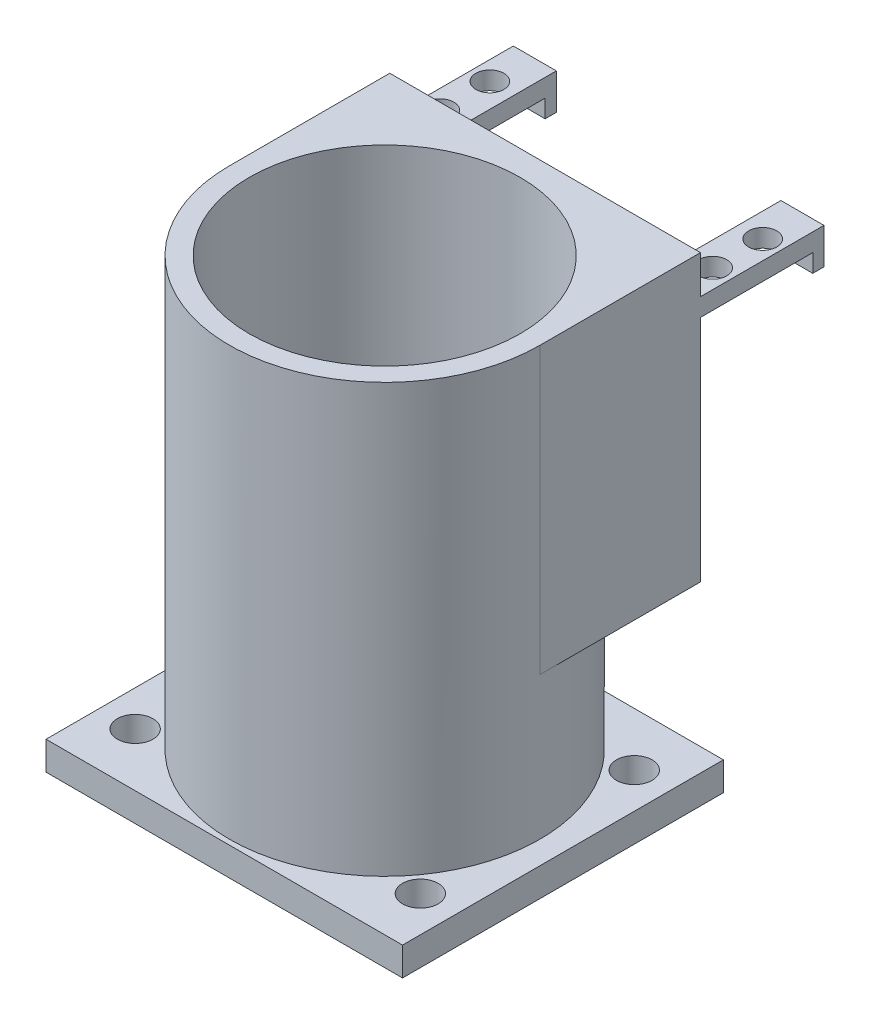
ISO-10303-21;
HEADER;
FILE_DESCRIPTION(('STEP AP214'),'2;1');
FILE_NAME('part.step','',(''),(''),'','','');
FILE_SCHEMA(('AUTOMOTIVE_DESIGN { 1 0 10303 214 1 1 1 1 }'));
ENDSEC;
DATA;
#1=APPLICATION_CONTEXT('core data for automotive mechanical design processes');
#2=APPLICATION_PROTOCOL_DEFINITION('international standard','automotive_design',2000,#1);
#3=PRODUCT_CONTEXT('',#1,'mechanical');
#4=PRODUCT('Part','Part','',(#3));
#5=PRODUCT_RELATED_PRODUCT_CATEGORY('part','',(#4));
#6=PRODUCT_DEFINITION_FORMATION('','',#4);
#7=PRODUCT_DEFINITION_CONTEXT('part definition',#1,'design');
#8=PRODUCT_DEFINITION('design','',#6,#7);
#9=PRODUCT_DEFINITION_SHAPE('','',#8);
#10=(LENGTH_UNIT() NAMED_UNIT(*) SI_UNIT(.MILLI.,.METRE.));
#11=(NAMED_UNIT(*) PLANE_ANGLE_UNIT() SI_UNIT($,.RADIAN.));
#12=(NAMED_UNIT(*) SI_UNIT($,.STERADIAN.) SOLID_ANGLE_UNIT());
#13=UNCERTAINTY_MEASURE_WITH_UNIT(LENGTH_MEASURE(1.E-05),#10,'distance_accuracy_value','');
#14=(GEOMETRIC_REPRESENTATION_CONTEXT(3) GLOBAL_UNCERTAINTY_ASSIGNED_CONTEXT((#13)) GLOBAL_UNIT_ASSIGNED_CONTEXT((#10,
#11,#12)) REPRESENTATION_CONTEXT('',''));
#15=CARTESIAN_POINT('',(0.,0.,0.));
#16=DIRECTION('',(0.,0.,1.));
#17=DIRECTION('',(1.,0.,0.));
#18=AXIS2_PLACEMENT_3D('',#15,#16,#17);
#19=CARTESIAN_POINT('',(51.75,71.28,-20.));
#20=DIRECTION('',(0.,1.,0.));
#21=DIRECTION('',(-1.,0.,0.));
#22=AXIS2_PLACEMENT_3D('',#19,#20,#21);
#23=PLANE('',#22);
#24=CARTESIAN_POINT('',(56.0499999999997,71.2800000000001,-5.55));
#25=DIRECTION('',(0.,-1.,0.));
#26=DIRECTION('',(-1.,0.,0.));
#27=AXIS2_PLACEMENT_3D('',#24,#25,#26);
#28=CIRCLE('',#27,2.5);
#29=CARTESIAN_POINT('',(53.5499999999997,71.2800000000001,-5.55));
#30=VERTEX_POINT('',#29);
#31=EDGE_CURVE('E241',#30,#30,#28,.T.);
#32=ORIENTED_EDGE('',*,*,#31,.F.);
#33=EDGE_LOOP('',(#32));
#34=FACE_BOUND('',#33,.T.);
#35=CARTESIAN_POINT('',(56.0499999999997,71.2800000000001,-14.45));
#36=DIRECTION('',(0.,-1.,0.));
#37=DIRECTION('',(1.,0.,0.));
#38=AXIS2_PLACEMENT_3D('',#35,#36,#37);
#39=CIRCLE('',#38,2.5);
#40=CARTESIAN_POINT('',(58.5499999999997,71.2800000000001,-14.45));
#41=VERTEX_POINT('',#40);
#42=EDGE_CURVE('E245',#41,#41,#39,.T.);
#43=ORIENTED_EDGE('',*,*,#42,.F.);
#44=EDGE_LOOP('',(#43));
#45=FACE_BOUND('',#44,.T.);
#46=DIRECTION('',(-1.,0.,0.));
#47=VECTOR('',#46,1.);
#48=CARTESIAN_POINT('',(59.4199999999997,71.2800000000001,-20.));
#49=LINE('',#48,#47);
#50=CARTESIAN_POINT('',(59.4199999999997,71.2800000000001,-20.));
#51=VERTEX_POINT('',#50);
#52=CARTESIAN_POINT('',(51.7499999999997,71.2800000000001,-20.));
#53=VERTEX_POINT('',#52);
#54=EDGE_CURVE('E198',#51,#53,#49,.T.);
#55=ORIENTED_EDGE('',*,*,#54,.F.);
#56=DIRECTION('',(0.,0.,1.));
#57=VECTOR('',#56,1.);
#58=CARTESIAN_POINT('',(59.42,71.28,-20.));
#59=LINE('',#58,#57);
#60=CARTESIAN_POINT('',(59.42,71.28,0.));
#61=VERTEX_POINT('',#60);
#62=EDGE_CURVE('E54',#51,#61,#59,.T.);
#63=ORIENTED_EDGE('',*,*,#62,.T.);
#64=DIRECTION('',(-1.,0.,0.));
#65=VECTOR('',#64,1.);
#66=CARTESIAN_POINT('',(51.75,71.28,0.));
#67=LINE('',#66,#65);
#68=CARTESIAN_POINT('',(51.75,71.28,0.));
#69=VERTEX_POINT('',#68);
#70=EDGE_CURVE('E269',#61,#69,#67,.T.);
#71=ORIENTED_EDGE('',*,*,#70,.T.);
#72=DIRECTION('',(0.,0.,1.));
#73=VECTOR('',#72,1.);
#74=CARTESIAN_POINT('',(51.75,71.28,-20.));
#75=LINE('',#74,#73);
#76=EDGE_CURVE('E271',#53,#69,#75,.T.);
#77=ORIENTED_EDGE('',*,*,#76,.F.);
#78=EDGE_LOOP('',(#55,#63,#71,#77));
#79=FACE_BOUND('',#78,.T.);
#80=ADVANCED_FACE('F39',(#34,#45,#79),#23,.F.);
#81=CARTESIAN_POINT('',(11.75,71.28,-20.));
#82=DIRECTION('',(0.,1.,0.));
#83=DIRECTION('',(-1.,0.,0.));
#84=AXIS2_PLACEMENT_3D('',#81,#82,#83);
#85=PLANE('',#84);
#86=CARTESIAN_POINT('',(7.45000000000001,71.28,-5.55));
#87=DIRECTION('',(0.,-1.,0.));
#88=DIRECTION('',(1.,0.,0.));
#89=AXIS2_PLACEMENT_3D('',#86,#87,#88);
#90=CIRCLE('',#89,2.5);
#91=CARTESIAN_POINT('',(9.95000000000001,71.28,-5.55));
#92=VERTEX_POINT('',#91);
#93=EDGE_CURVE('E244',#92,#92,#90,.T.);
#94=ORIENTED_EDGE('',*,*,#93,.F.);
#95=EDGE_LOOP('',(#94));
#96=FACE_BOUND('',#95,.T.);
#97=CARTESIAN_POINT('',(7.45000000000001,71.28,-14.45));
#98=DIRECTION('',(0.,-1.,0.));
#99=DIRECTION('',(-1.,0.,0.));
#100=AXIS2_PLACEMENT_3D('',#97,#98,#99);
#101=CIRCLE('',#100,2.5);
#102=CARTESIAN_POINT('',(4.95000000000001,71.28,-14.45));
#103=VERTEX_POINT('',#102);
#104=EDGE_CURVE('E240',#103,#103,#101,.T.);
#105=ORIENTED_EDGE('',*,*,#104,.F.);
#106=EDGE_LOOP('',(#105));
#107=FACE_BOUND('',#106,.T.);
#108=DIRECTION('',(-1.,0.,0.));
#109=VECTOR('',#108,1.);
#110=CARTESIAN_POINT('',(4.08000000000001,71.28,-20.));
#111=LINE('',#110,#109);
#112=CARTESIAN_POINT('',(11.75,71.28,-20.));
#113=VERTEX_POINT('',#112);
#114=CARTESIAN_POINT('',(4.08000000000001,71.28,-20.));
#115=VERTEX_POINT('',#114);
#116=EDGE_CURVE('E203',#113,#115,#111,.T.);
#117=ORIENTED_EDGE('',*,*,#116,.F.);
#118=DIRECTION('',(0.,0.,1.));
#119=VECTOR('',#118,1.);
#120=CARTESIAN_POINT('',(11.75,71.28,-20.));
#121=LINE('',#120,#119);
#122=CARTESIAN_POINT('',(11.75,71.28,0.));
#123=VERTEX_POINT('',#122);
#124=EDGE_CURVE('E291',#113,#123,#121,.T.);
#125=ORIENTED_EDGE('',*,*,#124,.T.);
#126=DIRECTION('',(-1.,0.,0.));
#127=VECTOR('',#126,1.);
#128=CARTESIAN_POINT('',(11.75,71.28,0.));
#129=LINE('',#128,#127);
#130=CARTESIAN_POINT('',(4.08000000000001,71.28,0.));
#131=VERTEX_POINT('',#130);
#132=EDGE_CURVE('E283',#123,#131,#129,.T.);
#133=ORIENTED_EDGE('',*,*,#132,.T.);
#134=DIRECTION('',(0.,0.,1.));
#135=VECTOR('',#134,1.);
#136=CARTESIAN_POINT('',(4.08000000000001,71.28,-20.));
#137=LINE('',#136,#135);
#138=EDGE_CURVE('E289',#115,#131,#137,.T.);
#139=ORIENTED_EDGE('',*,*,#138,.F.);
#140=EDGE_LOOP('',(#117,#125,#133,#139));
#141=FACE_BOUND('',#140,.T.);
#142=ADVANCED_FACE('F434',(#96,#107,#141),#85,.F.);
#143=CARTESIAN_POINT('',(0.,0.,0.));
#144=DIRECTION('',(0.,0.,-1.));
#145=DIRECTION('',(-1.,0.,0.));
#146=AXIS2_PLACEMENT_3D('',#143,#144,#145);
#147=PLANE('',#146);
#148=DIRECTION('',(0.,-1.,0.));
#149=VECTOR('',#148,1.);
#150=CARTESIAN_POINT('',(59.42,81.28,0.));
#151=LINE('',#150,#149);
#152=CARTESIAN_POINT('',(59.42,81.28,0.));
#153=VERTEX_POINT('',#152);
#154=CARTESIAN_POINT('',(59.42,74.48,0.));
#155=VERTEX_POINT('',#154);
#156=EDGE_CURVE('E307',#153,#155,#151,.T.);
#157=ORIENTED_EDGE('',*,*,#156,.T.);
#158=DIRECTION('',(1.,0.,0.));
#159=VECTOR('',#158,1.);
#160=CARTESIAN_POINT('',(51.75,74.48,0.));
#161=LINE('',#160,#159);
#162=CARTESIAN_POINT('',(51.75,74.48,0.));
#163=VERTEX_POINT('',#162);
#164=EDGE_CURVE('E267',#163,#155,#161,.T.);
#165=ORIENTED_EDGE('',*,*,#164,.F.);
#166=DIRECTION('',(0.,1.,0.));
#167=VECTOR('',#166,1.);
#168=CARTESIAN_POINT('',(51.75,74.48,0.));
#169=LINE('',#168,#167);
#170=EDGE_CURVE('E264',#69,#163,#169,.T.);
#171=ORIENTED_EDGE('',*,*,#170,.F.);
#172=ORIENTED_EDGE('',*,*,#70,.F.);
#173=CARTESIAN_POINT('',(59.42,30.48,0.));
#174=VERTEX_POINT('',#173);
#175=EDGE_CURVE('E310',#61,#174,#151,.T.);
#176=ORIENTED_EDGE('',*,*,#175,.T.);
#177=DIRECTION('',(-1.,0.,0.));
#178=VECTOR('',#177,1.);
#179=CARTESIAN_POINT('',(59.42,30.48,0.));
#180=LINE('',#179,#178);
#181=CARTESIAN_POINT('',(4.08,30.48,0.));
#182=VERTEX_POINT('',#181);
#183=EDGE_CURVE('E304',#174,#182,#180,.T.);
#184=ORIENTED_EDGE('',*,*,#183,.T.);
#185=DIRECTION('',(0.,1.,0.));
#186=VECTOR('',#185,1.);
#187=CARTESIAN_POINT('',(4.08000000000001,81.28,0.));
#188=LINE('',#187,#186);
#189=EDGE_CURVE('E300',#182,#131,#188,.T.);
#190=ORIENTED_EDGE('',*,*,#189,.T.);
#191=ORIENTED_EDGE('',*,*,#132,.F.);
#192=DIRECTION('',(0.,-1.,0.));
#193=VECTOR('',#192,1.);
#194=CARTESIAN_POINT('',(11.75,74.48,0.));
#195=LINE('',#194,#193);
#196=CARTESIAN_POINT('',(11.75,74.48,0.));
#197=VERTEX_POINT('',#196);
#198=EDGE_CURVE('E62',#197,#123,#195,.T.);
#199=ORIENTED_EDGE('',*,*,#198,.F.);
#200=DIRECTION('',(1.,0.,0.));
#201=VECTOR('',#200,1.);
#202=CARTESIAN_POINT('',(11.75,74.48,0.));
#203=LINE('',#202,#201);
#204=CARTESIAN_POINT('',(4.08000000000001,74.48,0.));
#205=VERTEX_POINT('',#204);
#206=EDGE_CURVE('E279',#205,#197,#203,.T.);
#207=ORIENTED_EDGE('',*,*,#206,.F.);
#208=CARTESIAN_POINT('',(4.08000000000001,81.28,0.));
#209=VERTEX_POINT('',#208);
#210=EDGE_CURVE('E303',#205,#209,#188,.T.);
#211=ORIENTED_EDGE('',*,*,#210,.T.);
#212=DIRECTION('',(1.,0.,0.));
#213=VECTOR('',#212,1.);
#214=CARTESIAN_POINT('',(59.42,81.28,0.));
#215=LINE('',#214,#213);
#216=EDGE_CURVE('E296',#209,#153,#215,.T.);
#217=ORIENTED_EDGE('',*,*,#216,.T.);
#218=EDGE_LOOP('',(#157,#165,#171,#172,#176,#184,#190,#191,#199,#207,#211,#217));
#219=FACE_BOUND('',#218,.T.);
#220=ADVANCED_FACE('F411',(#219),#147,.T.);
#221=CARTESIAN_POINT('',(0.,5.08,0.));
#222=DIRECTION('',(0.,1.,0.));
#223=DIRECTION('',(0.,0.,1.));
#224=AXIS2_PLACEMENT_3D('',#221,#222,#223);
#225=PLANE('',#224);
#226=CARTESIAN_POINT('',(31.75,5.08,28.575));
#227=DIRECTION('',(0.,1.,0.));
#228=DIRECTION('',(0.,0.,1.));
#229=AXIS2_PLACEMENT_3D('',#226,#227,#228);
#230=CIRCLE('',#229,27.67);
#231=CARTESIAN_POINT('',(31.75,5.08,56.245));
#232=VERTEX_POINT('',#231);
#233=EDGE_CURVE('E330',#232,#232,#230,.T.);
#234=ORIENTED_EDGE('',*,*,#233,.F.);
#235=EDGE_LOOP('',(#234));
#236=FACE_BOUND('',#235,.T.);
#237=CARTESIAN_POINT('',(57.15,5.08,47.625));
#238=DIRECTION('',(0.,1.,0.));
#239=DIRECTION('',(0.,0.,-1.));
#240=AXIS2_PLACEMENT_3D('',#237,#238,#239);
#241=CIRCLE('',#240,3.175);
#242=CARTESIAN_POINT('',(57.15,5.08,44.45));
#243=VERTEX_POINT('',#242);
#244=EDGE_CURVE('E343',#243,#243,#241,.T.);
#245=ORIENTED_EDGE('',*,*,#244,.F.);
#246=EDGE_LOOP('',(#245));
#247=FACE_BOUND('',#246,.T.);
#248=CARTESIAN_POINT('',(6.35,5.08,9.525));
#249=DIRECTION('',(0.,1.,0.));
#250=DIRECTION('',(0.,0.,1.));
#251=AXIS2_PLACEMENT_3D('',#248,#249,#250);
#252=CIRCLE('',#251,3.175);
#253=CARTESIAN_POINT('',(6.35,5.08,12.7));
#254=VERTEX_POINT('',#253);
#255=EDGE_CURVE('E355',#254,#254,#252,.T.);
#256=ORIENTED_EDGE('',*,*,#255,.F.);
#257=EDGE_LOOP('',(#256));
#258=FACE_BOUND('',#257,.T.);
#259=DIRECTION('',(0.,0.,1.));
#260=VECTOR('',#259,1.);
#261=CARTESIAN_POINT('',(0.,5.08,0.));
#262=LINE('',#261,#260);
#263=CARTESIAN_POINT('',(0.,5.08,0.));
#264=VERTEX_POINT('',#263);
#265=CARTESIAN_POINT('',(0.,5.08,57.15));
#266=VERTEX_POINT('',#265);
#267=EDGE_CURVE('E361',#264,#266,#262,.T.);
#268=ORIENTED_EDGE('',*,*,#267,.T.);
#269=DIRECTION('',(1.,0.,0.));
#270=VECTOR('',#269,1.);
#271=CARTESIAN_POINT('',(0.,5.08,57.15));
#272=LINE('',#271,#270);
#273=CARTESIAN_POINT('',(63.5,5.08,57.15));
#274=VERTEX_POINT('',#273);
#275=EDGE_CURVE('E364',#266,#274,#272,.T.);
#276=ORIENTED_EDGE('',*,*,#275,.T.);
#277=DIRECTION('',(0.,0.,-1.));
#278=VECTOR('',#277,1.);
#279=CARTESIAN_POINT('',(63.5,5.08,0.));
#280=LINE('',#279,#278);
#281=CARTESIAN_POINT('',(63.5,5.08,0.));
#282=VERTEX_POINT('',#281);
#283=EDGE_CURVE('E367',#274,#282,#280,.T.);
#284=ORIENTED_EDGE('',*,*,#283,.T.);
#285=DIRECTION('',(-1.,0.,0.));
#286=VECTOR('',#285,1.);
#287=CARTESIAN_POINT('',(0.,5.08,0.));
#288=LINE('',#287,#286);
#289=EDGE_CURVE('E369',#282,#264,#288,.T.);
#290=ORIENTED_EDGE('',*,*,#289,.T.);
#291=EDGE_LOOP('',(#268,#276,#284,#290));
#292=FACE_BOUND('',#291,.T.);
#293=CARTESIAN_POINT('',(57.15,5.08,9.525));
#294=DIRECTION('',(0.,1.,0.));
#295=DIRECTION('',(0.,0.,1.));
#296=AXIS2_PLACEMENT_3D('',#293,#294,#295);
#297=CIRCLE('',#296,3.175);
#298=CARTESIAN_POINT('',(57.15,5.08,12.7));
#299=VERTEX_POINT('',#298);
#300=EDGE_CURVE('E349',#299,#299,#297,.T.);
#301=ORIENTED_EDGE('',*,*,#300,.F.);
#302=EDGE_LOOP('',(#301));
#303=FACE_BOUND('',#302,.T.);
#304=CARTESIAN_POINT('',(6.35,5.08,47.625));
#305=DIRECTION('',(0.,1.,0.));
#306=DIRECTION('',(0.,0.,-1.));
#307=AXIS2_PLACEMENT_3D('',#304,#305,#306);
#308=CIRCLE('',#307,3.175);
#309=CARTESIAN_POINT('',(6.35,5.08,44.45));
#310=VERTEX_POINT('',#309);
#311=EDGE_CURVE('E337',#310,#310,#308,.T.);
#312=ORIENTED_EDGE('',*,*,#311,.F.);
#313=EDGE_LOOP('',(#312));
#314=FACE_BOUND('',#313,.T.);
#315=ADVANCED_FACE('F408',(#236,#247,#258,#292,#303,#314),#225,.T.);
#316=CARTESIAN_POINT('',(0.,0.,0.));
#317=DIRECTION('',(0.,1.,0.));
#318=DIRECTION('',(0.,0.,1.));
#319=AXIS2_PLACEMENT_3D('',#316,#317,#318);
#320=PLANE('',#319);
#321=DIRECTION('',(0.,0.,1.));
#322=VECTOR('',#321,1.);
#323=CARTESIAN_POINT('',(0.,0.,0.));
#324=LINE('',#323,#322);
#325=CARTESIAN_POINT('',(0.,0.,0.));
#326=VERTEX_POINT('',#325);
#327=CARTESIAN_POINT('',(0.,0.,57.15));
#328=VERTEX_POINT('',#327);
#329=EDGE_CURVE('E358',#326,#328,#324,.T.);
#330=ORIENTED_EDGE('',*,*,#329,.F.);
#331=DIRECTION('',(-1.,0.,0.));
#332=VECTOR('',#331,1.);
#333=CARTESIAN_POINT('',(0.,0.,0.));
#334=LINE('',#333,#332);
#335=CARTESIAN_POINT('',(63.5,0.,0.));
#336=VERTEX_POINT('',#335);
#337=EDGE_CURVE('E365',#336,#326,#334,.T.);
#338=ORIENTED_EDGE('',*,*,#337,.F.);
#339=DIRECTION('',(0.,0.,-1.));
#340=VECTOR('',#339,1.);
#341=CARTESIAN_POINT('',(63.5,0.,0.));
#342=LINE('',#341,#340);
#343=CARTESIAN_POINT('',(63.5,0.,57.15));
#344=VERTEX_POINT('',#343);
#345=EDGE_CURVE('E376',#344,#336,#342,.T.);
#346=ORIENTED_EDGE('',*,*,#345,.F.);
#347=DIRECTION('',(1.,0.,0.));
#348=VECTOR('',#347,1.);
#349=CARTESIAN_POINT('',(0.,0.,57.15));
#350=LINE('',#349,#348);
#351=EDGE_CURVE('E374',#328,#344,#350,.T.);
#352=ORIENTED_EDGE('',*,*,#351,.F.);
#353=EDGE_LOOP('',(#330,#338,#346,#352));
#354=FACE_BOUND('',#353,.T.);
#355=CARTESIAN_POINT('',(6.35,0.,9.525));
#356=DIRECTION('',(0.,1.,0.));
#357=DIRECTION('',(0.,0.,1.));
#358=AXIS2_PLACEMENT_3D('',#355,#356,#357);
#359=CIRCLE('',#358,3.175);
#360=CARTESIAN_POINT('',(6.35,0.,12.7));
#361=VERTEX_POINT('',#360);
#362=EDGE_CURVE('E352',#361,#361,#359,.T.);
#363=ORIENTED_EDGE('',*,*,#362,.T.);
#364=EDGE_LOOP('',(#363));
#365=FACE_BOUND('',#364,.T.);
#366=CARTESIAN_POINT('',(57.15,0.,9.525));
#367=DIRECTION('',(0.,1.,0.));
#368=DIRECTION('',(0.,0.,1.));
#369=AXIS2_PLACEMENT_3D('',#366,#367,#368);
#370=CIRCLE('',#369,3.175);
#371=CARTESIAN_POINT('',(57.15,0.,12.7));
#372=VERTEX_POINT('',#371);
#373=EDGE_CURVE('E346',#372,#372,#370,.T.);
#374=ORIENTED_EDGE('',*,*,#373,.T.);
#375=EDGE_LOOP('',(#374));
#376=FACE_BOUND('',#375,.T.);
#377=CARTESIAN_POINT('',(57.15,0.,47.625));
#378=DIRECTION('',(0.,1.,0.));
#379=DIRECTION('',(0.,0.,-1.));
#380=AXIS2_PLACEMENT_3D('',#377,#378,#379);
#381=CIRCLE('',#380,3.175);
#382=CARTESIAN_POINT('',(57.15,0.,44.45));
#383=VERTEX_POINT('',#382);
#384=EDGE_CURVE('E340',#383,#383,#381,.T.);
#385=ORIENTED_EDGE('',*,*,#384,.T.);
#386=EDGE_LOOP('',(#385));
#387=FACE_BOUND('',#386,.T.);
#388=CARTESIAN_POINT('',(6.35,0.,47.625));
#389=DIRECTION('',(0.,1.,0.));
#390=DIRECTION('',(0.,0.,-1.));
#391=AXIS2_PLACEMENT_3D('',#388,#389,#390);
#392=CIRCLE('',#391,3.175);
#393=CARTESIAN_POINT('',(6.35,0.,44.45));
#394=VERTEX_POINT('',#393);
#395=EDGE_CURVE('E334',#394,#394,#392,.T.);
#396=ORIENTED_EDGE('',*,*,#395,.T.);
#397=EDGE_LOOP('',(#396));
#398=FACE_BOUND('',#397,.T.);
#399=ADVANCED_FACE('F397',(#354,#365,#376,#387,#398),#320,.F.);
#400=CARTESIAN_POINT('',(0.,5.08,0.));
#401=DIRECTION('',(1.,0.,0.));
#402=DIRECTION('',(0.,0.,-1.));
#403=AXIS2_PLACEMENT_3D('',#400,#401,#402);
#404=PLANE('',#403);
#405=ORIENTED_EDGE('',*,*,#329,.T.);
#406=DIRECTION('',(0.,-1.,0.));
#407=VECTOR('',#406,1.);
#408=CARTESIAN_POINT('',(0.,5.08,57.15));
#409=LINE('',#408,#407);
#410=EDGE_CURVE('E47',#266,#328,#409,.T.);
#411=ORIENTED_EDGE('',*,*,#410,.F.);
#412=ORIENTED_EDGE('',*,*,#267,.F.);
#413=DIRECTION('',(0.,-1.,0.));
#414=VECTOR('',#413,1.);
#415=CARTESIAN_POINT('',(0.,5.08,0.));
#416=LINE('',#415,#414);
#417=EDGE_CURVE('E371',#264,#326,#416,.T.);
#418=ORIENTED_EDGE('',*,*,#417,.T.);
#419=EDGE_LOOP('',(#405,#411,#412,#418));
#420=FACE_BOUND('',#419,.T.);
#421=ADVANCED_FACE('F41',(#420),#404,.F.);
#422=CARTESIAN_POINT('',(0.,5.08,57.15));
#423=DIRECTION('',(0.,0.,-1.));
#424=DIRECTION('',(-1.,0.,0.));
#425=AXIS2_PLACEMENT_3D('',#422,#423,#424);
#426=PLANE('',#425);
#427=ORIENTED_EDGE('',*,*,#351,.T.);
#428=DIRECTION('',(0.,-1.,0.));
#429=VECTOR('',#428,1.);
#430=CARTESIAN_POINT('',(63.5,5.08,57.15));
#431=LINE('',#430,#429);
#432=EDGE_CURVE('E384',#274,#344,#431,.T.);
#433=ORIENTED_EDGE('',*,*,#432,.F.);
#434=ORIENTED_EDGE('',*,*,#275,.F.);
#435=ORIENTED_EDGE('',*,*,#410,.T.);
#436=EDGE_LOOP('',(#427,#433,#434,#435));
#437=FACE_BOUND('',#436,.T.);
#438=ADVANCED_FACE('F389',(#437),#426,.F.);
#439=CARTESIAN_POINT('',(63.5,5.08,0.));
#440=DIRECTION('',(-1.,0.,0.));
#441=DIRECTION('',(0.,0.,1.));
#442=AXIS2_PLACEMENT_3D('',#439,#440,#441);
#443=PLANE('',#442);
#444=ORIENTED_EDGE('',*,*,#345,.T.);
#445=DIRECTION('',(0.,-1.,0.));
#446=VECTOR('',#445,1.);
#447=CARTESIAN_POINT('',(63.5,5.08,0.));
#448=LINE('',#447,#446);
#449=EDGE_CURVE('E381',#282,#336,#448,.T.);
#450=ORIENTED_EDGE('',*,*,#449,.F.);
#451=ORIENTED_EDGE('',*,*,#283,.F.);
#452=ORIENTED_EDGE('',*,*,#432,.T.);
#453=EDGE_LOOP('',(#444,#450,#451,#452));
#454=FACE_BOUND('',#453,.T.);
#455=ADVANCED_FACE('F402',(#454),#443,.F.);
#456=CARTESIAN_POINT('',(0.,5.08,0.));
#457=DIRECTION('',(0.,0.,1.));
#458=DIRECTION('',(1.,0.,0.));
#459=AXIS2_PLACEMENT_3D('',#456,#457,#458);
#460=PLANE('',#459);
#461=ORIENTED_EDGE('',*,*,#337,.T.);
#462=ORIENTED_EDGE('',*,*,#417,.F.);
#463=ORIENTED_EDGE('',*,*,#289,.F.);
#464=ORIENTED_EDGE('',*,*,#449,.T.);
#465=EDGE_LOOP('',(#461,#462,#463,#464));
#466=FACE_BOUND('',#465,.T.);
#467=ADVANCED_FACE('F406',(#466),#460,.F.);
#468=CARTESIAN_POINT('',(6.35,5.08,9.525));
#469=DIRECTION('',(0.,-1.,0.));
#470=DIRECTION('',(0.,0.,-1.));
#471=AXIS2_PLACEMENT_3D('',#468,#469,#470);
#472=CYLINDRICAL_SURFACE('',#471,3.175);
#473=ORIENTED_EDGE('',*,*,#255,.T.);
#474=EDGE_LOOP('',(#473));
#475=FACE_BOUND('',#474,.T.);
#476=ORIENTED_EDGE('',*,*,#362,.F.);
#477=EDGE_LOOP('',(#476));
#478=FACE_BOUND('',#477,.T.);
#479=ADVANCED_FACE('F494',(#475,#478),#472,.F.);
#480=CARTESIAN_POINT('',(57.15,5.08,9.525));
#481=DIRECTION('',(0.,-1.,0.));
#482=DIRECTION('',(0.,0.,-1.));
#483=AXIS2_PLACEMENT_3D('',#480,#481,#482);
#484=CYLINDRICAL_SURFACE('',#483,3.175);
#485=ORIENTED_EDGE('',*,*,#300,.T.);
#486=EDGE_LOOP('',(#485));
#487=FACE_BOUND('',#486,.T.);
#488=ORIENTED_EDGE('',*,*,#373,.F.);
#489=EDGE_LOOP('',(#488));
#490=FACE_BOUND('',#489,.T.);
#491=ADVANCED_FACE('F490',(#487,#490),#484,.F.);
#492=CARTESIAN_POINT('',(57.15,5.08,47.625));
#493=DIRECTION('',(0.,-1.,0.));
#494=DIRECTION('',(0.,0.,-1.));
#495=AXIS2_PLACEMENT_3D('',#492,#493,#494);
#496=CYLINDRICAL_SURFACE('',#495,3.175);
#497=ORIENTED_EDGE('',*,*,#244,.T.);
#498=EDGE_LOOP('',(#497));
#499=FACE_BOUND('',#498,.T.);
#500=ORIENTED_EDGE('',*,*,#384,.F.);
#501=EDGE_LOOP('',(#500));
#502=FACE_BOUND('',#501,.T.);
#503=ADVANCED_FACE('F423',(#499,#502),#496,.F.);
#504=CARTESIAN_POINT('',(6.35,5.08,47.625));
#505=DIRECTION('',(0.,-1.,0.));
#506=DIRECTION('',(0.,0.,-1.));
#507=AXIS2_PLACEMENT_3D('',#504,#505,#506);
#508=CYLINDRICAL_SURFACE('',#507,3.175);
#509=ORIENTED_EDGE('',*,*,#311,.T.);
#510=EDGE_LOOP('',(#509));
#511=FACE_BOUND('',#510,.T.);
#512=ORIENTED_EDGE('',*,*,#395,.F.);
#513=EDGE_LOOP('',(#512));
#514=FACE_BOUND('',#513,.T.);
#515=ADVANCED_FACE('F419',(#511,#514),#508,.F.);
#516=CARTESIAN_POINT('',(31.75,81.28,28.575));
#517=DIRECTION('',(0.,1.,0.));
#518=DIRECTION('',(0.,0.,1.));
#519=AXIS2_PLACEMENT_3D('',#516,#517,#518);
#520=PLANE('',#519);
#521=CARTESIAN_POINT('',(31.75,81.28,28.575));
#522=DIRECTION('',(0.,1.,0.));
#523=DIRECTION('',(0.,0.,1.));
#524=AXIS2_PLACEMENT_3D('',#521,#522,#523);
#525=CIRCLE('',#524,27.67);
#526=CARTESIAN_POINT('',(4.08000000000001,81.28,28.575));
#527=VERTEX_POINT('',#526);
#528=CARTESIAN_POINT('',(59.42,81.28,28.575));
#529=VERTEX_POINT('',#528);
#530=EDGE_CURVE('E331',#527,#529,#525,.T.);
#531=ORIENTED_EDGE('',*,*,#530,.T.);
#532=DIRECTION('',(0.,0.,-1.));
#533=VECTOR('',#532,1.);
#534=CARTESIAN_POINT('',(59.42,81.28,57.151));
#535=LINE('',#534,#533);
#536=EDGE_CURVE('E295',#529,#153,#535,.T.);
#537=ORIENTED_EDGE('',*,*,#536,.T.);
#538=ORIENTED_EDGE('',*,*,#216,.F.);
#539=DIRECTION('',(0.,0.,-1.));
#540=VECTOR('',#539,1.);
#541=CARTESIAN_POINT('',(4.08000000000001,81.28,57.151));
#542=LINE('',#541,#540);
#543=EDGE_CURVE('E313',#527,#209,#542,.T.);
#544=ORIENTED_EDGE('',*,*,#543,.F.);
#545=EDGE_LOOP('',(#531,#537,#538,#544));
#546=FACE_BOUND('',#545,.T.);
#547=CARTESIAN_POINT('',(31.75,81.28,28.575));
#548=DIRECTION('',(0.,1.,0.));
#549=DIRECTION('',(0.,0.,1.));
#550=AXIS2_PLACEMENT_3D('',#547,#548,#549);
#551=CIRCLE('',#550,24.13);
#552=CARTESIAN_POINT('',(31.75,81.28,52.705));
#553=VERTEX_POINT('',#552);
#554=EDGE_CURVE('E323',#553,#553,#551,.T.);
#555=ORIENTED_EDGE('',*,*,#554,.F.);
#556=EDGE_LOOP('',(#555));
#557=FACE_BOUND('',#556,.T.);
#558=ADVANCED_FACE('F422',(#546,#557),#520,.T.);
#559=CARTESIAN_POINT('',(31.75,81.28,28.575));
#560=DIRECTION('',(0.,-1.,0.));
#561=DIRECTION('',(0.,0.,-1.));
#562=AXIS2_PLACEMENT_3D('',#559,#560,#561);
#563=CYLINDRICAL_SURFACE('',#562,27.67);
#564=ORIENTED_EDGE('',*,*,#530,.F.);
#565=DIRECTION('',(0.,-1.,0.));
#566=VECTOR('',#565,1.);
#567=CARTESIAN_POINT('',(4.08000000000001,81.28,28.575));
#568=LINE('',#567,#566);
#569=CARTESIAN_POINT('',(4.08000000000001,30.48,28.575));
#570=VERTEX_POINT('',#569);
#571=EDGE_CURVE('E312',#570,#527,#568,.F.);
#572=ORIENTED_EDGE('',*,*,#571,.F.);
#573=CARTESIAN_POINT('',(31.75,30.48,28.575));
#574=DIRECTION('',(0.,-1.,0.));
#575=DIRECTION('',(1.,0.,0.));
#576=AXIS2_PLACEMENT_3D('',#573,#574,#575);
#577=CIRCLE('',#576,27.67);
#578=CARTESIAN_POINT('',(59.42,30.48,28.575));
#579=VERTEX_POINT('',#578);
#580=EDGE_CURVE('E316',#579,#570,#577,.F.);
#581=ORIENTED_EDGE('',*,*,#580,.F.);
#582=DIRECTION('',(0.,-1.,0.));
#583=VECTOR('',#582,1.);
#584=CARTESIAN_POINT('',(59.42,81.28,28.575));
#585=LINE('',#584,#583);
#586=EDGE_CURVE('E299',#579,#529,#585,.F.);
#587=ORIENTED_EDGE('',*,*,#586,.T.);
#588=EDGE_LOOP('',(#564,#572,#581,#587));
#589=FACE_BOUND('',#588,.T.);
#590=ORIENTED_EDGE('',*,*,#233,.T.);
#591=EDGE_LOOP('',(#590));
#592=FACE_BOUND('',#591,.T.);
#593=ADVANCED_FACE('F480',(#589,#592),#563,.T.);
#594=CARTESIAN_POINT('',(31.75,81.28,28.575));
#595=DIRECTION('',(0.,-1.,0.));
#596=DIRECTION('',(0.,0.,-1.));
#597=AXIS2_PLACEMENT_3D('',#594,#595,#596);
#598=CYLINDRICAL_SURFACE('',#597,24.13);
#599=ORIENTED_EDGE('',*,*,#554,.T.);
#600=EDGE_LOOP('',(#599));
#601=FACE_BOUND('',#600,.T.);
#602=CARTESIAN_POINT('',(31.75,5.08,28.575));
#603=DIRECTION('',(0.,1.,0.));
#604=DIRECTION('',(0.,0.,1.));
#605=AXIS2_PLACEMENT_3D('',#602,#603,#604);
#606=CIRCLE('',#605,24.13);
#607=CARTESIAN_POINT('',(31.75,5.08,52.705));
#608=VERTEX_POINT('',#607);
#609=EDGE_CURVE('E12',#608,#608,#606,.F.);
#610=ORIENTED_EDGE('',*,*,#609,.T.);
#611=EDGE_LOOP('',(#610));
#612=FACE_BOUND('',#611,.T.);
#613=ADVANCED_FACE('F477',(#601,#612),#598,.F.);
#614=ORIENTED_EDGE('',*,*,#609,.F.);
#615=EDGE_LOOP('',(#614));
#616=FACE_BOUND('',#615,.T.);
#617=ADVANCED_FACE('F414',(#616),#225,.T.);
#618=CARTESIAN_POINT('',(4.08000000000001,81.28,57.151));
#619=DIRECTION('',(-1.,0.,0.));
#620=DIRECTION('',(0.,-1.,0.));
#621=AXIS2_PLACEMENT_3D('',#618,#619,#620);
#622=PLANE('',#621);
#623=DIRECTION('',(0.,0.,-1.));
#624=VECTOR('',#623,1.);
#625=CARTESIAN_POINT('',(4.08,30.48,57.151));
#626=LINE('',#625,#624);
#627=EDGE_CURVE('E317',#570,#182,#626,.T.);
#628=ORIENTED_EDGE('',*,*,#627,.F.);
#629=ORIENTED_EDGE('',*,*,#571,.T.);
#630=ORIENTED_EDGE('',*,*,#543,.T.);
#631=ORIENTED_EDGE('',*,*,#210,.F.);
#632=DIRECTION('',(0.,0.,1.));
#633=VECTOR('',#632,1.);
#634=CARTESIAN_POINT('',(4.08000000000001,74.48,-20.));
#635=LINE('',#634,#633);
#636=CARTESIAN_POINT('',(4.08000000000001,74.48,-22.));
#637=VERTEX_POINT('',#636);
#638=EDGE_CURVE('E286',#637,#205,#635,.T.);
#639=ORIENTED_EDGE('',*,*,#638,.F.);
#640=DIRECTION('',(0.,1.,0.));
#641=VECTOR('',#640,1.);
#642=CARTESIAN_POINT('',(4.08000000000001,74.48,-22.));
#643=LINE('',#642,#641);
#644=CARTESIAN_POINT('',(4.08000000000001,68.08,-22.));
#645=VERTEX_POINT('',#644);
#646=EDGE_CURVE('E226',#645,#637,#643,.T.);
#647=ORIENTED_EDGE('',*,*,#646,.F.);
#648=DIRECTION('',(0.,0.,-1.));
#649=VECTOR('',#648,1.);
#650=CARTESIAN_POINT('',(4.08000000000001,68.08,-20.));
#651=LINE('',#650,#649);
#652=CARTESIAN_POINT('',(4.08000000000001,68.08,-20.));
#653=VERTEX_POINT('',#652);
#654=EDGE_CURVE('E205',#653,#645,#651,.T.);
#655=ORIENTED_EDGE('',*,*,#654,.F.);
#656=DIRECTION('',(0.,1.,0.));
#657=VECTOR('',#656,1.);
#658=CARTESIAN_POINT('',(4.08000000000001,68.08,-20.));
#659=LINE('',#658,#657);
#660=EDGE_CURVE('E218',#653,#115,#659,.T.);
#661=ORIENTED_EDGE('',*,*,#660,.T.);
#662=ORIENTED_EDGE('',*,*,#138,.T.);
#663=ORIENTED_EDGE('',*,*,#189,.F.);
#664=EDGE_LOOP('',(#628,#629,#630,#631,#639,#647,#655,#661,#662,#663));
#665=FACE_BOUND('',#664,.T.);
#666=ADVANCED_FACE('F467',(#665),#622,.T.);
#667=CARTESIAN_POINT('',(59.42,30.48,57.151));
#668=DIRECTION('',(0.,-1.,0.));
#669=DIRECTION('',(1.,0.,0.));
#670=AXIS2_PLACEMENT_3D('',#667,#668,#669);
#671=PLANE('',#670);
#672=DIRECTION('',(0.,0.,-1.));
#673=VECTOR('',#672,1.);
#674=CARTESIAN_POINT('',(59.42,30.48,57.151));
#675=LINE('',#674,#673);
#676=EDGE_CURVE('E319',#579,#174,#675,.T.);
#677=ORIENTED_EDGE('',*,*,#676,.F.);
#678=ORIENTED_EDGE('',*,*,#580,.T.);
#679=ORIENTED_EDGE('',*,*,#627,.T.);
#680=ORIENTED_EDGE('',*,*,#183,.F.);
#681=EDGE_LOOP('',(#677,#678,#679,#680));
#682=FACE_BOUND('',#681,.T.);
#683=ADVANCED_FACE('F470',(#682),#671,.T.);
#684=CARTESIAN_POINT('',(59.42,81.28,57.151));
#685=DIRECTION('',(1.,0.,0.));
#686=DIRECTION('',(0.,1.,0.));
#687=AXIS2_PLACEMENT_3D('',#684,#685,#686);
#688=PLANE('',#687);
#689=ORIENTED_EDGE('',*,*,#586,.F.);
#690=ORIENTED_EDGE('',*,*,#676,.T.);
#691=ORIENTED_EDGE('',*,*,#175,.F.);
#692=ORIENTED_EDGE('',*,*,#62,.F.);
#693=DIRECTION('',(0.,1.,0.));
#694=VECTOR('',#693,1.);
#695=CARTESIAN_POINT('',(59.4199999999997,68.0800000000001,-20.));
#696=LINE('',#695,#694);
#697=CARTESIAN_POINT('',(59.4199999999997,68.0800000000001,-20.));
#698=VERTEX_POINT('',#697);
#699=EDGE_CURVE('E182',#698,#51,#696,.T.);
#700=ORIENTED_EDGE('',*,*,#699,.F.);
#701=DIRECTION('',(0.,0.,1.));
#702=VECTOR('',#701,1.);
#703=CARTESIAN_POINT('',(59.4199999999997,68.0800000000001,-20.));
#704=LINE('',#703,#702);
#705=CARTESIAN_POINT('',(59.4199999999997,68.0800000000001,-22.));
#706=VERTEX_POINT('',#705);
#707=EDGE_CURVE('E189',#706,#698,#704,.T.);
#708=ORIENTED_EDGE('',*,*,#707,.F.);
#709=DIRECTION('',(0.,-1.,0.));
#710=VECTOR('',#709,1.);
#711=CARTESIAN_POINT('',(59.42,74.48,-22.));
#712=LINE('',#711,#710);
#713=CARTESIAN_POINT('',(59.42,74.48,-22.));
#714=VERTEX_POINT('',#713);
#715=EDGE_CURVE('E232',#714,#706,#712,.T.);
#716=ORIENTED_EDGE('',*,*,#715,.F.);
#717=DIRECTION('',(0.,0.,1.));
#718=VECTOR('',#717,1.);
#719=CARTESIAN_POINT('',(59.42,74.48,-20.));
#720=LINE('',#719,#718);
#721=EDGE_CURVE('E274',#714,#155,#720,.T.);
#722=ORIENTED_EDGE('',*,*,#721,.T.);
#723=ORIENTED_EDGE('',*,*,#156,.F.);
#724=ORIENTED_EDGE('',*,*,#536,.F.);
#725=EDGE_LOOP('',(#689,#690,#691,#692,#700,#708,#716,#722,#723,#724));
#726=FACE_BOUND('',#725,.T.);
#727=ADVANCED_FACE('F201',(#726),#688,.T.);
#728=CARTESIAN_POINT('',(11.75,74.48,-20.));
#729=DIRECTION('',(0.,-1.,0.));
#730=DIRECTION('',(0.,0.,-1.));
#731=AXIS2_PLACEMENT_3D('',#728,#729,#730);
#732=PLANE('',#731);
#733=CARTESIAN_POINT('',(7.45,74.48,-14.45));
#734=DIRECTION('',(0.,-1.,0.));
#735=DIRECTION('',(0.,0.,-1.));
#736=AXIS2_PLACEMENT_3D('',#733,#734,#735);
#737=CIRCLE('',#736,2.5);
#738=CARTESIAN_POINT('',(7.45,74.48,-16.95));
#739=VERTEX_POINT('',#738);
#740=EDGE_CURVE('E261',#739,#739,#737,.T.);
#741=ORIENTED_EDGE('',*,*,#740,.T.);
#742=EDGE_LOOP('',(#741));
#743=FACE_BOUND('',#742,.T.);
#744=CARTESIAN_POINT('',(7.45,74.48,-5.55));
#745=DIRECTION('',(0.,-1.,0.));
#746=DIRECTION('',(0.,0.,-1.));
#747=AXIS2_PLACEMENT_3D('',#744,#745,#746);
#748=CIRCLE('',#747,2.5);
#749=CARTESIAN_POINT('',(7.45,74.48,-8.05));
#750=VERTEX_POINT('',#749);
#751=EDGE_CURVE('E258',#750,#750,#748,.T.);
#752=ORIENTED_EDGE('',*,*,#751,.T.);
#753=EDGE_LOOP('',(#752));
#754=FACE_BOUND('',#753,.T.);
#755=ORIENTED_EDGE('',*,*,#206,.T.);
#756=DIRECTION('',(0.,0.,1.));
#757=VECTOR('',#756,1.);
#758=CARTESIAN_POINT('',(11.75,74.48,-20.));
#759=LINE('',#758,#757);
#760=CARTESIAN_POINT('',(11.75,74.48,-22.));
#761=VERTEX_POINT('',#760);
#762=EDGE_CURVE('E293',#761,#197,#759,.T.);
#763=ORIENTED_EDGE('',*,*,#762,.F.);
#764=DIRECTION('',(1.,0.,0.));
#765=VECTOR('',#764,1.);
#766=CARTESIAN_POINT('',(11.75,74.48,-22.));
#767=LINE('',#766,#765);
#768=EDGE_CURVE('E229',#637,#761,#767,.T.);
#769=ORIENTED_EDGE('',*,*,#768,.F.);
#770=ORIENTED_EDGE('',*,*,#638,.T.);
#771=EDGE_LOOP('',(#755,#763,#769,#770));
#772=FACE_BOUND('',#771,.T.);
#773=ADVANCED_FACE('F460',(#743,#754,#772),#732,.F.);
#774=CARTESIAN_POINT('',(11.75,74.48,-20.));
#775=DIRECTION('',(-1.,0.,0.));
#776=DIRECTION('',(0.,0.,1.));
#777=AXIS2_PLACEMENT_3D('',#774,#775,#776);
#778=PLANE('',#777);
#779=ORIENTED_EDGE('',*,*,#198,.T.);
#780=ORIENTED_EDGE('',*,*,#124,.F.);
#781=DIRECTION('',(0.,1.,0.));
#782=VECTOR('',#781,1.);
#783=CARTESIAN_POINT('',(11.75,68.08,-20.));
#784=LINE('',#783,#782);
#785=CARTESIAN_POINT('',(11.75,68.08,-20.));
#786=VERTEX_POINT('',#785);
#787=EDGE_CURVE('E222',#786,#113,#784,.T.);
#788=ORIENTED_EDGE('',*,*,#787,.F.);
#789=DIRECTION('',(0.,0.,1.));
#790=VECTOR('',#789,1.);
#791=CARTESIAN_POINT('',(11.75,68.08,-20.));
#792=LINE('',#791,#790);
#793=CARTESIAN_POINT('',(11.75,68.08,-22.));
#794=VERTEX_POINT('',#793);
#795=EDGE_CURVE('E215',#794,#786,#792,.T.);
#796=ORIENTED_EDGE('',*,*,#795,.F.);
#797=DIRECTION('',(0.,-1.,0.));
#798=VECTOR('',#797,1.);
#799=CARTESIAN_POINT('',(11.75,74.48,-22.));
#800=LINE('',#799,#798);
#801=EDGE_CURVE('E224',#761,#794,#800,.T.);
#802=ORIENTED_EDGE('',*,*,#801,.F.);
#803=ORIENTED_EDGE('',*,*,#762,.T.);
#804=EDGE_LOOP('',(#779,#780,#788,#796,#802,#803));
#805=FACE_BOUND('',#804,.T.);
#806=ADVANCED_FACE('F455',(#805),#778,.F.);
#807=CARTESIAN_POINT('',(51.75,74.48,-20.));
#808=DIRECTION('',(1.,0.,0.));
#809=DIRECTION('',(0.,0.,-1.));
#810=AXIS2_PLACEMENT_3D('',#807,#808,#809);
#811=PLANE('',#810);
#812=ORIENTED_EDGE('',*,*,#170,.T.);
#813=DIRECTION('',(0.,0.,1.));
#814=VECTOR('',#813,1.);
#815=CARTESIAN_POINT('',(51.75,74.48,-20.));
#816=LINE('',#815,#814);
#817=CARTESIAN_POINT('',(51.75,74.48,-22.));
#818=VERTEX_POINT('',#817);
#819=EDGE_CURVE('E277',#818,#163,#816,.T.);
#820=ORIENTED_EDGE('',*,*,#819,.F.);
#821=DIRECTION('',(0.,1.,0.));
#822=VECTOR('',#821,1.);
#823=CARTESIAN_POINT('',(51.75,74.48,-22.));
#824=LINE('',#823,#822);
#825=CARTESIAN_POINT('',(51.7499999999997,68.0800000000001,-22.));
#826=VERTEX_POINT('',#825);
#827=EDGE_CURVE('E234',#826,#818,#824,.T.);
#828=ORIENTED_EDGE('',*,*,#827,.F.);
#829=DIRECTION('',(0.,0.,-1.));
#830=VECTOR('',#829,1.);
#831=CARTESIAN_POINT('',(51.7499999999997,68.0800000000001,-20.));
#832=LINE('',#831,#830);
#833=CARTESIAN_POINT('',(51.7499999999997,68.0800000000001,-20.));
#834=VERTEX_POINT('',#833);
#835=EDGE_CURVE('E188',#834,#826,#832,.T.);
#836=ORIENTED_EDGE('',*,*,#835,.F.);
#837=DIRECTION('',(0.,1.,0.));
#838=VECTOR('',#837,1.);
#839=CARTESIAN_POINT('',(51.7499999999997,68.0800000000001,-20.));
#840=LINE('',#839,#838);
#841=EDGE_CURVE('E184',#834,#53,#840,.T.);
#842=ORIENTED_EDGE('',*,*,#841,.T.);
#843=ORIENTED_EDGE('',*,*,#76,.T.);
#844=EDGE_LOOP('',(#812,#820,#828,#836,#842,#843));
#845=FACE_BOUND('',#844,.T.);
#846=ADVANCED_FACE('F452',(#845),#811,.F.);
#847=CARTESIAN_POINT('',(51.75,74.48,-20.));
#848=DIRECTION('',(0.,-1.,0.));
#849=DIRECTION('',(0.,0.,-1.));
#850=AXIS2_PLACEMENT_3D('',#847,#848,#849);
#851=PLANE('',#850);
#852=CARTESIAN_POINT('',(56.0499999999997,74.48,-14.45));
#853=DIRECTION('',(0.,-1.,0.));
#854=DIRECTION('',(0.,0.,-1.));
#855=AXIS2_PLACEMENT_3D('',#852,#853,#854);
#856=CIRCLE('',#855,2.5);
#857=CARTESIAN_POINT('',(56.0499999999997,74.48,-16.95));
#858=VERTEX_POINT('',#857);
#859=EDGE_CURVE('E255',#858,#858,#856,.T.);
#860=ORIENTED_EDGE('',*,*,#859,.T.);
#861=EDGE_LOOP('',(#860));
#862=FACE_BOUND('',#861,.T.);
#863=CARTESIAN_POINT('',(56.0499999999997,74.48,-5.55));
#864=DIRECTION('',(0.,-1.,0.));
#865=DIRECTION('',(0.,0.,-1.));
#866=AXIS2_PLACEMENT_3D('',#863,#864,#865);
#867=CIRCLE('',#866,2.5);
#868=CARTESIAN_POINT('',(56.0499999999997,74.48,-8.05));
#869=VERTEX_POINT('',#868);
#870=EDGE_CURVE('E252',#869,#869,#867,.T.);
#871=ORIENTED_EDGE('',*,*,#870,.T.);
#872=EDGE_LOOP('',(#871));
#873=FACE_BOUND('',#872,.T.);
#874=ORIENTED_EDGE('',*,*,#164,.T.);
#875=ORIENTED_EDGE('',*,*,#721,.F.);
#876=DIRECTION('',(1.,0.,0.));
#877=VECTOR('',#876,1.);
#878=CARTESIAN_POINT('',(59.42,74.48,-22.));
#879=LINE('',#878,#877);
#880=EDGE_CURVE('E237',#818,#714,#879,.T.);
#881=ORIENTED_EDGE('',*,*,#880,.F.);
#882=ORIENTED_EDGE('',*,*,#819,.T.);
#883=EDGE_LOOP('',(#874,#875,#881,#882));
#884=FACE_BOUND('',#883,.T.);
#885=ADVANCED_FACE('F448',(#862,#873,#884),#851,.F.);
#886=CARTESIAN_POINT('',(56.0499999999997,81.2800000000001,-5.55));
#887=DIRECTION('',(0.,-1.,0.));
#888=DIRECTION('',(1.,0.,0.));
#889=AXIS2_PLACEMENT_3D('',#886,#887,#888);
#890=CYLINDRICAL_SURFACE('',#889,2.5);
#891=ORIENTED_EDGE('',*,*,#31,.T.);
#892=EDGE_LOOP('',(#891));
#893=FACE_BOUND('',#892,.T.);
#894=ORIENTED_EDGE('',*,*,#870,.F.);
#895=EDGE_LOOP('',(#894));
#896=FACE_BOUND('',#895,.T.);
#897=ADVANCED_FACE('F451',(#893,#896),#890,.F.);
#898=CARTESIAN_POINT('',(56.0499999999997,81.2800000000001,-14.45));
#899=DIRECTION('',(0.,-1.,0.));
#900=DIRECTION('',(1.,0.,0.));
#901=AXIS2_PLACEMENT_3D('',#898,#899,#900);
#902=CYLINDRICAL_SURFACE('',#901,2.5);
#903=ORIENTED_EDGE('',*,*,#42,.T.);
#904=EDGE_LOOP('',(#903));
#905=FACE_BOUND('',#904,.T.);
#906=ORIENTED_EDGE('',*,*,#859,.F.);
#907=EDGE_LOOP('',(#906));
#908=FACE_BOUND('',#907,.T.);
#909=ADVANCED_FACE('F608',(#905,#908),#902,.F.);
#910=CARTESIAN_POINT('',(7.44999999999999,81.28,-5.55));
#911=DIRECTION('',(0.,-1.,0.));
#912=DIRECTION('',(1.,0.,0.));
#913=AXIS2_PLACEMENT_3D('',#910,#911,#912);
#914=CYLINDRICAL_SURFACE('',#913,2.5);
#915=ORIENTED_EDGE('',*,*,#93,.T.);
#916=EDGE_LOOP('',(#915));
#917=FACE_BOUND('',#916,.T.);
#918=ORIENTED_EDGE('',*,*,#751,.F.);
#919=EDGE_LOOP('',(#918));
#920=FACE_BOUND('',#919,.T.);
#921=ADVANCED_FACE('F446',(#917,#920),#914,.F.);
#922=CARTESIAN_POINT('',(7.44999999999999,81.28,-14.45));
#923=DIRECTION('',(0.,-1.,0.));
#924=DIRECTION('',(1.,0.,0.));
#925=AXIS2_PLACEMENT_3D('',#922,#923,#924);
#926=CYLINDRICAL_SURFACE('',#925,2.5);
#927=ORIENTED_EDGE('',*,*,#104,.T.);
#928=EDGE_LOOP('',(#927));
#929=FACE_BOUND('',#928,.T.);
#930=ORIENTED_EDGE('',*,*,#740,.F.);
#931=EDGE_LOOP('',(#930));
#932=FACE_BOUND('',#931,.T.);
#933=ADVANCED_FACE('F628',(#929,#932),#926,.F.);
#934=CARTESIAN_POINT('',(0.,0.,-22.));
#935=DIRECTION('',(0.,0.,-1.));
#936=DIRECTION('',(-1.,0.,0.));
#937=AXIS2_PLACEMENT_3D('',#934,#935,#936);
#938=PLANE('',#937);
#939=ORIENTED_EDGE('',*,*,#715,.T.);
#940=DIRECTION('',(1.,0.,0.));
#941=VECTOR('',#940,1.);
#942=CARTESIAN_POINT('',(59.4199999999997,68.0800000000001,-22.));
#943=LINE('',#942,#941);
#944=EDGE_CURVE('E195',#826,#706,#943,.T.);
#945=ORIENTED_EDGE('',*,*,#944,.F.);
#946=ORIENTED_EDGE('',*,*,#827,.T.);
#947=ORIENTED_EDGE('',*,*,#880,.T.);
#948=EDGE_LOOP('',(#939,#945,#946,#947));
#949=FACE_BOUND('',#948,.T.);
#950=ADVANCED_FACE('F637',(#949),#938,.T.);
#951=CARTESIAN_POINT('',(0.,0.,-22.));
#952=DIRECTION('',(0.,0.,-1.));
#953=DIRECTION('',(-1.,0.,0.));
#954=AXIS2_PLACEMENT_3D('',#951,#952,#953);
#955=PLANE('',#954);
#956=ORIENTED_EDGE('',*,*,#801,.T.);
#957=DIRECTION('',(1.,0.,0.));
#958=VECTOR('',#957,1.);
#959=CARTESIAN_POINT('',(4.08000000000001,68.08,-22.));
#960=LINE('',#959,#958);
#961=EDGE_CURVE('E212',#645,#794,#960,.T.);
#962=ORIENTED_EDGE('',*,*,#961,.F.);
#963=ORIENTED_EDGE('',*,*,#646,.T.);
#964=ORIENTED_EDGE('',*,*,#768,.T.);
#965=EDGE_LOOP('',(#956,#962,#963,#964));
#966=FACE_BOUND('',#965,.T.);
#967=ADVANCED_FACE('F700',(#966),#955,.T.);
#968=CARTESIAN_POINT('',(4.08000000000001,68.08,-20.));
#969=DIRECTION('',(0.,0.,-1.));
#970=DIRECTION('',(-1.,0.,0.));
#971=AXIS2_PLACEMENT_3D('',#968,#969,#970);
#972=PLANE('',#971);
#973=ORIENTED_EDGE('',*,*,#116,.T.);
#974=ORIENTED_EDGE('',*,*,#660,.F.);
#975=DIRECTION('',(-1.,0.,0.));
#976=VECTOR('',#975,1.);
#977=CARTESIAN_POINT('',(4.08000000000001,68.08,-20.));
#978=LINE('',#977,#976);
#979=EDGE_CURVE('E217',#786,#653,#978,.T.);
#980=ORIENTED_EDGE('',*,*,#979,.F.);
#981=ORIENTED_EDGE('',*,*,#787,.T.);
#982=EDGE_LOOP('',(#973,#974,#980,#981));
#983=FACE_BOUND('',#982,.T.);
#984=ADVANCED_FACE('F710',(#983),#972,.F.);
#985=CARTESIAN_POINT('',(-1.23181198690483E-13,68.08,0.));
#986=DIRECTION('',(0.,-1.,0.));
#987=DIRECTION('',(1.,0.,0.));
#988=AXIS2_PLACEMENT_3D('',#985,#986,#987);
#989=PLANE('',#988);
#990=ORIENTED_EDGE('',*,*,#654,.T.);
#991=ORIENTED_EDGE('',*,*,#961,.T.);
#992=ORIENTED_EDGE('',*,*,#795,.T.);
#993=ORIENTED_EDGE('',*,*,#979,.T.);
#994=EDGE_LOOP('',(#990,#991,#992,#993));
#995=FACE_BOUND('',#994,.T.);
#996=ADVANCED_FACE('F721',(#995),#989,.T.);
#997=CARTESIAN_POINT('',(59.4199999999997,68.0800000000001,-20.));
#998=DIRECTION('',(0.,0.,-1.));
#999=DIRECTION('',(-1.,0.,0.));
#1000=AXIS2_PLACEMENT_3D('',#997,#998,#999);
#1001=PLANE('',#1000);
#1002=ORIENTED_EDGE('',*,*,#54,.T.);
#1003=ORIENTED_EDGE('',*,*,#841,.F.);
#1004=DIRECTION('',(-1.,0.,0.));
#1005=VECTOR('',#1004,1.);
#1006=CARTESIAN_POINT('',(59.4199999999997,68.0800000000001,-20.));
#1007=LINE('',#1006,#1005);
#1008=EDGE_CURVE('E178',#698,#834,#1007,.T.);
#1009=ORIENTED_EDGE('',*,*,#1008,.F.);
#1010=ORIENTED_EDGE('',*,*,#699,.T.);
#1011=EDGE_LOOP('',(#1002,#1003,#1009,#1010));
#1012=FACE_BOUND('',#1011,.T.);
#1013=ADVANCED_FACE('F180',(#1012),#1001,.F.);
#1014=CARTESIAN_POINT('',(-1.23181198690484E-13,68.08,0.));
#1015=DIRECTION('',(0.,1.,0.));
#1016=DIRECTION('',(-1.,0.,0.));
#1017=AXIS2_PLACEMENT_3D('',#1014,#1015,#1016);
#1018=PLANE('',#1017);
#1019=ORIENTED_EDGE('',*,*,#707,.T.);
#1020=ORIENTED_EDGE('',*,*,#1008,.T.);
#1021=ORIENTED_EDGE('',*,*,#835,.T.);
#1022=ORIENTED_EDGE('',*,*,#944,.T.);
#1023=EDGE_LOOP('',(#1019,#1020,#1021,#1022));
#1024=FACE_BOUND('',#1023,.T.);
#1025=ADVANCED_FACE('F193',(#1024),#1018,.F.);
#1026=CLOSED_SHELL('',(#80,#142,#220,#315,#399,#421,#438,#455,#467,#479,#491,#503,#515,#558,
#593,#613,#617,#666,#683,#727,#773,#806,#846,#885,#897,#909,#921,#933,#950,#967,#984,#996,#1013,#1025));
#1027=MANIFOLD_SOLID_BREP('B2',#1026);
#1028=ADVANCED_BREP_SHAPE_REPRESENTATION('',(#18,#1027),#14);
#1029=SHAPE_DEFINITION_REPRESENTATION(#9,#1028);
ENDSEC;
END-ISO-10303-21;
